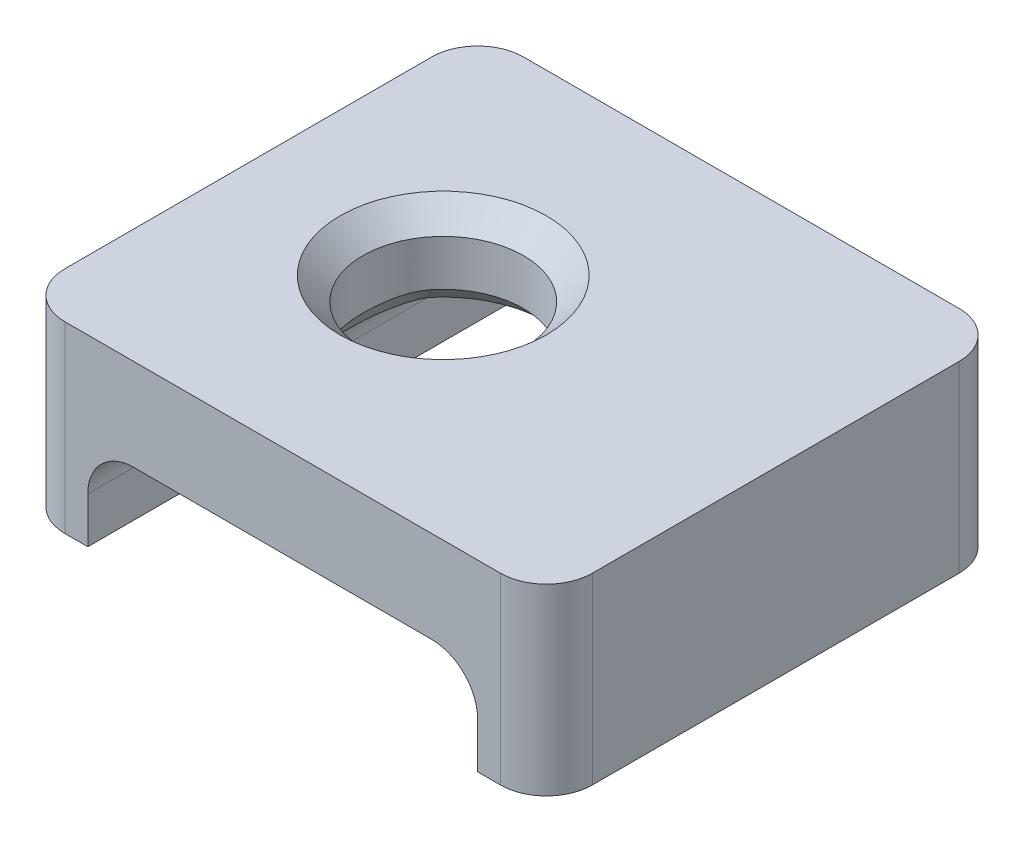
ISO-10303-21;
HEADER;
FILE_DESCRIPTION(('STEP AP214'),'2;1');
FILE_NAME('part.step','',(''),(''),'','','');
FILE_SCHEMA(('AUTOMOTIVE_DESIGN { 1 0 10303 214 1 1 1 1 }'));
ENDSEC;
DATA;
#1=APPLICATION_CONTEXT('core data for automotive mechanical design processes');
#2=APPLICATION_PROTOCOL_DEFINITION('international standard','automotive_design',2000,#1);
#3=PRODUCT_CONTEXT('',#1,'mechanical');
#4=PRODUCT('Part','Part','',(#3));
#5=PRODUCT_RELATED_PRODUCT_CATEGORY('part','',(#4));
#6=PRODUCT_DEFINITION_FORMATION('','',#4);
#7=PRODUCT_DEFINITION_CONTEXT('part definition',#1,'design');
#8=PRODUCT_DEFINITION('design','',#6,#7);
#9=PRODUCT_DEFINITION_SHAPE('','',#8);
#10=(LENGTH_UNIT() NAMED_UNIT(*) SI_UNIT(.MILLI.,.METRE.));
#11=(NAMED_UNIT(*) PLANE_ANGLE_UNIT() SI_UNIT($,.RADIAN.));
#12=(NAMED_UNIT(*) SI_UNIT($,.STERADIAN.) SOLID_ANGLE_UNIT());
#13=UNCERTAINTY_MEASURE_WITH_UNIT(LENGTH_MEASURE(1.E-05),#10,'distance_accuracy_value','');
#14=(GEOMETRIC_REPRESENTATION_CONTEXT(3) GLOBAL_UNCERTAINTY_ASSIGNED_CONTEXT((#13)) GLOBAL_UNIT_ASSIGNED_CONTEXT((#10,
#11,#12)) REPRESENTATION_CONTEXT('',''));
#15=CARTESIAN_POINT('',(0.,0.,0.));
#16=DIRECTION('',(0.,0.,1.));
#17=DIRECTION('',(1.,0.,0.));
#18=AXIS2_PLACEMENT_3D('',#15,#16,#17);
#19=CARTESIAN_POINT('',(1.5,0.,5.));
#20=DIRECTION('',(0.,1.,0.));
#21=DIRECTION('',(-1.,0.,0.));
#22=AXIS2_PLACEMENT_3D('',#19,#20,#21);
#23=PLANE('',#22);
#24=DIRECTION('',(0.,0.,-1.));
#25=VECTOR('',#24,1.);
#26=CARTESIAN_POINT('',(0.,0.,5.));
#27=LINE('',#26,#25);
#28=CARTESIAN_POINT('',(0.,0.,4.));
#29=VERTEX_POINT('',#28);
#30=CARTESIAN_POINT('',(0.,0.,-4.));
#31=VERTEX_POINT('',#30);
#32=EDGE_CURVE('E344',#29,#31,#27,.T.);
#33=ORIENTED_EDGE('',*,*,#32,.T.);
#34=CARTESIAN_POINT('',(1.,0.,-4.));
#35=DIRECTION('',(0.,1.,0.));
#36=DIRECTION('',(-1.,0.,0.));
#37=AXIS2_PLACEMENT_3D('',#34,#35,#36);
#38=CIRCLE('',#37,1.);
#39=CARTESIAN_POINT('',(1.,0.,-5.));
#40=VERTEX_POINT('',#39);
#41=EDGE_CURVE('E190',#31,#40,#38,.F.);
#42=ORIENTED_EDGE('',*,*,#41,.T.);
#43=DIRECTION('',(1.,0.,0.));
#44=VECTOR('',#43,1.);
#45=CARTESIAN_POINT('',(1.5,0.,-5.));
#46=LINE('',#45,#44);
#47=CARTESIAN_POINT('',(1.5,0.,-5.));
#48=VERTEX_POINT('',#47);
#49=EDGE_CURVE('E174',#40,#48,#46,.T.);
#50=ORIENTED_EDGE('',*,*,#49,.T.);
#51=DIRECTION('',(0.,0.,-1.));
#52=VECTOR('',#51,1.);
#53=CARTESIAN_POINT('',(1.5,0.,5.));
#54=LINE('',#53,#52);
#55=CARTESIAN_POINT('',(1.5,0.,5.));
#56=VERTEX_POINT('',#55);
#57=EDGE_CURVE('E167',#56,#48,#54,.T.);
#58=ORIENTED_EDGE('',*,*,#57,.F.);
#59=DIRECTION('',(1.,0.,0.));
#60=VECTOR('',#59,1.);
#61=CARTESIAN_POINT('',(1.5,0.,5.));
#62=LINE('',#61,#60);
#63=CARTESIAN_POINT('',(1.,0.,5.));
#64=VERTEX_POINT('',#63);
#65=EDGE_CURVE('E151',#64,#56,#62,.T.);
#66=ORIENTED_EDGE('',*,*,#65,.F.);
#67=CARTESIAN_POINT('',(1.,0.,4.));
#68=DIRECTION('',(0.,1.,0.));
#69=DIRECTION('',(-1.,0.,0.));
#70=AXIS2_PLACEMENT_3D('',#67,#68,#69);
#71=CIRCLE('',#70,1.);
#72=EDGE_CURVE('E188',#64,#29,#71,.F.);
#73=ORIENTED_EDGE('',*,*,#72,.T.);
#74=EDGE_LOOP('',(#33,#42,#50,#58,#66,#73));
#75=FACE_BOUND('',#74,.T.);
#76=ADVANCED_FACE('F32',(#75),#23,.F.);
#77=CARTESIAN_POINT('',(1.5,0.,5.));
#78=DIRECTION('',(-1.,0.,0.));
#79=DIRECTION('',(0.,0.,1.));
#80=AXIS2_PLACEMENT_3D('',#77,#78,#79);
#81=PLANE('',#80);
#82=DIRECTION('',(0.,1.,0.));
#83=VECTOR('',#82,1.);
#84=CARTESIAN_POINT('',(1.5,0.,-5.));
#85=LINE('',#84,#83);
#86=CARTESIAN_POINT('',(1.5,1.,-5.));
#87=VERTEX_POINT('',#86);
#88=EDGE_CURVE('E338',#48,#87,#85,.T.);
#89=ORIENTED_EDGE('',*,*,#88,.T.);
#90=DIRECTION('',(0.,0.,-1.));
#91=VECTOR('',#90,1.);
#92=CARTESIAN_POINT('',(1.5,1.,5.));
#93=LINE('',#92,#91);
#94=CARTESIAN_POINT('',(1.5,1.,5.));
#95=VERTEX_POINT('',#94);
#96=EDGE_CURVE('E169',#87,#95,#93,.F.);
#97=ORIENTED_EDGE('',*,*,#96,.T.);
#98=DIRECTION('',(0.,1.,0.));
#99=VECTOR('',#98,1.);
#100=CARTESIAN_POINT('',(1.5,0.,5.));
#101=LINE('',#100,#99);
#102=EDGE_CURVE('E155',#56,#95,#101,.T.);
#103=ORIENTED_EDGE('',*,*,#102,.F.);
#104=ORIENTED_EDGE('',*,*,#57,.T.);
#105=EDGE_LOOP('',(#89,#97,#103,#104));
#106=FACE_BOUND('',#105,.T.);
#107=ADVANCED_FACE('F166',(#106),#81,.F.);
#108=CARTESIAN_POINT('',(1.5,2.,5.));
#109=DIRECTION('',(0.,1.,0.));
#110=DIRECTION('',(-1.,0.,0.));
#111=AXIS2_PLACEMENT_3D('',#108,#109,#110);
#112=PLANE('',#111);
#113=DIRECTION('',(0.,0.,-1.));
#114=VECTOR('',#113,1.);
#115=CARTESIAN_POINT('',(2.5,2.,-5.));
#116=LINE('',#115,#114);
#117=CARTESIAN_POINT('',(2.5,2.,5.));
#118=VERTEX_POINT('',#117);
#119=CARTESIAN_POINT('',(2.5,2.,1.41421356237311));
#120=VERTEX_POINT('',#119);
#121=EDGE_CURVE('E228',#118,#120,#116,.T.);
#122=ORIENTED_EDGE('',*,*,#121,.T.);
#123=CARTESIAN_POINT('',(4.25,2.,0.));
#124=DIRECTION('',(0.,1.,0.));
#125=DIRECTION('',(-1.,0.,0.));
#126=AXIS2_PLACEMENT_3D('',#123,#124,#125);
#127=CIRCLE('',#126,2.25000000000001);
#128=CARTESIAN_POINT('',(2.5,2.,-1.41421356237311));
#129=VERTEX_POINT('',#128);
#130=EDGE_CURVE('E230',#120,#129,#127,.T.);
#131=ORIENTED_EDGE('',*,*,#130,.T.);
#132=DIRECTION('',(0.,0.,-1.));
#133=VECTOR('',#132,1.);
#134=CARTESIAN_POINT('',(2.5,2.,-5.));
#135=LINE('',#134,#133);
#136=CARTESIAN_POINT('',(2.5,2.,-5.));
#137=VERTEX_POINT('',#136);
#138=EDGE_CURVE('E220',#129,#137,#135,.T.);
#139=ORIENTED_EDGE('',*,*,#138,.T.);
#140=DIRECTION('',(1.,0.,0.));
#141=VECTOR('',#140,1.);
#142=CARTESIAN_POINT('',(1.5,2.,-5.));
#143=LINE('',#142,#141);
#144=CARTESIAN_POINT('',(9.,2.,-5.));
#145=VERTEX_POINT('',#144);
#146=EDGE_CURVE('E320',#137,#145,#143,.T.);
#147=ORIENTED_EDGE('',*,*,#146,.T.);
#148=DIRECTION('',(0.,0.,-1.));
#149=VECTOR('',#148,1.);
#150=CARTESIAN_POINT('',(9.,2.,5.));
#151=LINE('',#150,#149);
#152=CARTESIAN_POINT('',(9.,2.,5.));
#153=VERTEX_POINT('',#152);
#154=EDGE_CURVE('E317',#145,#153,#151,.F.);
#155=ORIENTED_EDGE('',*,*,#154,.T.);
#156=DIRECTION('',(1.,0.,0.));
#157=VECTOR('',#156,1.);
#158=CARTESIAN_POINT('',(1.5,2.,5.));
#159=LINE('',#158,#157);
#160=EDGE_CURVE('E170',#118,#153,#159,.T.);
#161=ORIENTED_EDGE('',*,*,#160,.F.);
#162=EDGE_LOOP('',(#122,#131,#139,#147,#155,#161));
#163=FACE_BOUND('',#162,.T.);
#164=ADVANCED_FACE('F304',(#163),#112,.F.);
#165=CARTESIAN_POINT('',(10.,2.,5.));
#166=DIRECTION('',(1.,0.,0.));
#167=DIRECTION('',(0.,0.,-1.));
#168=AXIS2_PLACEMENT_3D('',#165,#166,#167);
#169=PLANE('',#168);
#170=DIRECTION('',(0.,-1.,0.));
#171=VECTOR('',#170,1.);
#172=CARTESIAN_POINT('',(10.,2.,5.));
#173=LINE('',#172,#171);
#174=CARTESIAN_POINT('',(10.,1.,5.));
#175=VERTEX_POINT('',#174);
#176=CARTESIAN_POINT('',(10.,0.,5.));
#177=VERTEX_POINT('',#176);
#178=EDGE_CURVE('E324',#175,#177,#173,.T.);
#179=ORIENTED_EDGE('',*,*,#178,.F.);
#180=DIRECTION('',(0.,0.,-1.));
#181=VECTOR('',#180,1.);
#182=CARTESIAN_POINT('',(10.,1.,-5.));
#183=LINE('',#182,#181);
#184=CARTESIAN_POINT('',(10.,1.,-5.));
#185=VERTEX_POINT('',#184);
#186=EDGE_CURVE('E217',#175,#185,#183,.T.);
#187=ORIENTED_EDGE('',*,*,#186,.T.);
#188=DIRECTION('',(0.,-1.,0.));
#189=VECTOR('',#188,1.);
#190=CARTESIAN_POINT('',(10.,2.,-5.));
#191=LINE('',#190,#189);
#192=CARTESIAN_POINT('',(10.,0.,-5.));
#193=VERTEX_POINT('',#192);
#194=EDGE_CURVE('E331',#185,#193,#191,.T.);
#195=ORIENTED_EDGE('',*,*,#194,.T.);
#196=DIRECTION('',(0.,0.,-1.));
#197=VECTOR('',#196,1.);
#198=CARTESIAN_POINT('',(10.,0.,5.));
#199=LINE('',#198,#197);
#200=EDGE_CURVE('E177',#177,#193,#199,.T.);
#201=ORIENTED_EDGE('',*,*,#200,.F.);
#202=EDGE_LOOP('',(#179,#187,#195,#201));
#203=FACE_BOUND('',#202,.T.);
#204=ADVANCED_FACE('F329',(#203),#169,.F.);
#205=CARTESIAN_POINT('',(11.5,0.,5.));
#206=DIRECTION('',(0.,1.,0.));
#207=DIRECTION('',(-1.,0.,0.));
#208=AXIS2_PLACEMENT_3D('',#205,#206,#207);
#209=PLANE('',#208);
#210=DIRECTION('',(1.,0.,0.));
#211=VECTOR('',#210,1.);
#212=CARTESIAN_POINT('',(11.5,0.,-5.));
#213=LINE('',#212,#211);
#214=CARTESIAN_POINT('',(10.5,0.,-5.));
#215=VERTEX_POINT('',#214);
#216=EDGE_CURVE('E335',#193,#215,#213,.T.);
#217=ORIENTED_EDGE('',*,*,#216,.T.);
#218=CARTESIAN_POINT('',(10.5,0.,-4.));
#219=DIRECTION('',(0.,1.,0.));
#220=DIRECTION('',(-1.,0.,0.));
#221=AXIS2_PLACEMENT_3D('',#218,#219,#220);
#222=CIRCLE('',#221,1.);
#223=CARTESIAN_POINT('',(11.5,0.,-4.));
#224=VERTEX_POINT('',#223);
#225=EDGE_CURVE('E211',#215,#224,#222,.F.);
#226=ORIENTED_EDGE('',*,*,#225,.T.);
#227=DIRECTION('',(0.,0.,-1.));
#228=VECTOR('',#227,1.);
#229=CARTESIAN_POINT('',(11.5,0.,5.));
#230=LINE('',#229,#228);
#231=CARTESIAN_POINT('',(11.5,0.,4.));
#232=VERTEX_POINT('',#231);
#233=EDGE_CURVE('E182',#232,#224,#230,.T.);
#234=ORIENTED_EDGE('',*,*,#233,.F.);
#235=CARTESIAN_POINT('',(10.5,0.,4.));
#236=DIRECTION('',(0.,1.,0.));
#237=DIRECTION('',(-1.,0.,0.));
#238=AXIS2_PLACEMENT_3D('',#235,#236,#237);
#239=CIRCLE('',#238,1.);
#240=CARTESIAN_POINT('',(10.5,0.,5.));
#241=VERTEX_POINT('',#240);
#242=EDGE_CURVE('E209',#232,#241,#239,.F.);
#243=ORIENTED_EDGE('',*,*,#242,.T.);
#244=DIRECTION('',(1.,0.,0.));
#245=VECTOR('',#244,1.);
#246=CARTESIAN_POINT('',(11.5,0.,5.));
#247=LINE('',#246,#245);
#248=EDGE_CURVE('E384',#177,#241,#247,.T.);
#249=ORIENTED_EDGE('',*,*,#248,.F.);
#250=ORIENTED_EDGE('',*,*,#200,.T.);
#251=EDGE_LOOP('',(#217,#226,#234,#243,#249,#250));
#252=FACE_BOUND('',#251,.T.);
#253=ADVANCED_FACE('F417',(#252),#209,.F.);
#254=CARTESIAN_POINT('',(11.5,4.,5.));
#255=DIRECTION('',(-1.,0.,0.));
#256=DIRECTION('',(0.,-1.,0.));
#257=AXIS2_PLACEMENT_3D('',#254,#255,#256);
#258=PLANE('',#257);
#259=ORIENTED_EDGE('',*,*,#233,.T.);
#260=DIRECTION('',(0.,1.,0.));
#261=VECTOR('',#260,1.);
#262=CARTESIAN_POINT('',(11.5,4.,-4.));
#263=LINE('',#262,#261);
#264=CARTESIAN_POINT('',(11.5,4.,-4.));
#265=VERTEX_POINT('',#264);
#266=EDGE_CURVE('E206',#224,#265,#263,.T.);
#267=ORIENTED_EDGE('',*,*,#266,.T.);
#268=DIRECTION('',(0.,0.,-1.));
#269=VECTOR('',#268,1.);
#270=CARTESIAN_POINT('',(11.5,4.,5.));
#271=LINE('',#270,#269);
#272=CARTESIAN_POINT('',(11.5,4.,4.));
#273=VERTEX_POINT('',#272);
#274=EDGE_CURVE('E350',#273,#265,#271,.T.);
#275=ORIENTED_EDGE('',*,*,#274,.F.);
#276=DIRECTION('',(0.,1.,0.));
#277=VECTOR('',#276,1.);
#278=CARTESIAN_POINT('',(11.5,4.,4.));
#279=LINE('',#278,#277);
#280=EDGE_CURVE('E204',#273,#232,#279,.F.);
#281=ORIENTED_EDGE('',*,*,#280,.T.);
#282=EDGE_LOOP('',(#259,#267,#275,#281));
#283=FACE_BOUND('',#282,.T.);
#284=ADVANCED_FACE('F356',(#283),#258,.F.);
#285=CARTESIAN_POINT('',(0.,4.,5.));
#286=DIRECTION('',(0.,-1.,0.));
#287=DIRECTION('',(0.,0.,-1.));
#288=AXIS2_PLACEMENT_3D('',#285,#286,#287);
#289=PLANE('',#288);
#290=CARTESIAN_POINT('',(4.25,4.,0.));
#291=DIRECTION('',(0.,-1.,0.));
#292=DIRECTION('',(0.,0.,-1.));
#293=AXIS2_PLACEMENT_3D('',#290,#291,#292);
#294=CIRCLE('',#293,2.25);
#295=CARTESIAN_POINT('',(4.25,4.,-2.25));
#296=VERTEX_POINT('',#295);
#297=EDGE_CURVE('E11',#296,#296,#294,.T.);
#298=ORIENTED_EDGE('',*,*,#297,.T.);
#299=EDGE_LOOP('',(#298));
#300=FACE_BOUND('',#299,.T.);
#301=DIRECTION('',(-1.,0.,0.));
#302=VECTOR('',#301,1.);
#303=CARTESIAN_POINT('',(0.,4.,-5.));
#304=LINE('',#303,#302);
#305=CARTESIAN_POINT('',(10.5,4.,-5.));
#306=VERTEX_POINT('',#305);
#307=CARTESIAN_POINT('',(1.,4.,-5.));
#308=VERTEX_POINT('',#307);
#309=EDGE_CURVE('E161',#306,#308,#304,.T.);
#310=ORIENTED_EDGE('',*,*,#309,.T.);
#311=CARTESIAN_POINT('',(1.,4.,-4.));
#312=DIRECTION('',(0.,-1.,0.));
#313=DIRECTION('',(0.,0.,-1.));
#314=AXIS2_PLACEMENT_3D('',#311,#312,#313);
#315=CIRCLE('',#314,1.);
#316=CARTESIAN_POINT('',(0.,4.,-4.));
#317=VERTEX_POINT('',#316);
#318=EDGE_CURVE('E202',#308,#317,#315,.F.);
#319=ORIENTED_EDGE('',*,*,#318,.T.);
#320=DIRECTION('',(0.,0.,-1.));
#321=VECTOR('',#320,1.);
#322=CARTESIAN_POINT('',(0.,4.,5.));
#323=LINE('',#322,#321);
#324=CARTESIAN_POINT('',(0.,4.,4.));
#325=VERTEX_POINT('',#324);
#326=EDGE_CURVE('E346',#325,#317,#323,.T.);
#327=ORIENTED_EDGE('',*,*,#326,.F.);
#328=CARTESIAN_POINT('',(1.,4.,4.));
#329=DIRECTION('',(0.,-1.,0.));
#330=DIRECTION('',(0.,0.,-1.));
#331=AXIS2_PLACEMENT_3D('',#328,#329,#330);
#332=CIRCLE('',#331,1.);
#333=CARTESIAN_POINT('',(1.,4.,5.));
#334=VERTEX_POINT('',#333);
#335=EDGE_CURVE('E198',#325,#334,#332,.F.);
#336=ORIENTED_EDGE('',*,*,#335,.T.);
#337=DIRECTION('',(-1.,0.,0.));
#338=VECTOR('',#337,1.);
#339=CARTESIAN_POINT('',(0.,4.,5.));
#340=LINE('',#339,#338);
#341=CARTESIAN_POINT('',(10.5,4.,5.));
#342=VERTEX_POINT('',#341);
#343=EDGE_CURVE('E347',#342,#334,#340,.T.);
#344=ORIENTED_EDGE('',*,*,#343,.F.);
#345=CARTESIAN_POINT('',(10.5,4.,4.));
#346=DIRECTION('',(0.,-1.,0.));
#347=DIRECTION('',(0.,0.,-1.));
#348=AXIS2_PLACEMENT_3D('',#345,#346,#347);
#349=CIRCLE('',#348,1.);
#350=EDGE_CURVE('E196',#342,#273,#349,.F.);
#351=ORIENTED_EDGE('',*,*,#350,.T.);
#352=ORIENTED_EDGE('',*,*,#274,.T.);
#353=CARTESIAN_POINT('',(10.5,4.,-4.));
#354=DIRECTION('',(0.,-1.,0.));
#355=DIRECTION('',(0.,0.,-1.));
#356=AXIS2_PLACEMENT_3D('',#353,#354,#355);
#357=CIRCLE('',#356,1.);
#358=EDGE_CURVE('E200',#265,#306,#357,.F.);
#359=ORIENTED_EDGE('',*,*,#358,.T.);
#360=EDGE_LOOP('',(#310,#319,#327,#336,#344,#351,#352,#359));
#361=FACE_BOUND('',#360,.T.);
#362=ADVANCED_FACE('F367',(#300,#361),#289,.F.);
#363=CARTESIAN_POINT('',(0.,0.,5.));
#364=DIRECTION('',(1.,0.,0.));
#365=DIRECTION('',(0.,0.,-1.));
#366=AXIS2_PLACEMENT_3D('',#363,#364,#365);
#367=PLANE('',#366);
#368=ORIENTED_EDGE('',*,*,#326,.T.);
#369=DIRECTION('',(0.,-1.,0.));
#370=VECTOR('',#369,1.);
#371=CARTESIAN_POINT('',(0.,0.,-4.));
#372=LINE('',#371,#370);
#373=EDGE_CURVE('E179',#317,#31,#372,.T.);
#374=ORIENTED_EDGE('',*,*,#373,.T.);
#375=ORIENTED_EDGE('',*,*,#32,.F.);
#376=DIRECTION('',(0.,-1.,0.));
#377=VECTOR('',#376,1.);
#378=CARTESIAN_POINT('',(0.,0.,4.));
#379=LINE('',#378,#377);
#380=EDGE_CURVE('E176',#29,#325,#379,.F.);
#381=ORIENTED_EDGE('',*,*,#380,.T.);
#382=EDGE_LOOP('',(#368,#374,#375,#381));
#383=FACE_BOUND('',#382,.T.);
#384=ADVANCED_FACE('F376',(#383),#367,.F.);
#385=CARTESIAN_POINT('',(0.,0.,5.));
#386=DIRECTION('',(0.,0.,-1.));
#387=DIRECTION('',(-1.,0.,0.));
#388=AXIS2_PLACEMENT_3D('',#385,#386,#387);
#389=PLANE('',#388);
#390=ORIENTED_EDGE('',*,*,#343,.T.);
#391=DIRECTION('',(0.,-1.,0.));
#392=VECTOR('',#391,1.);
#393=CARTESIAN_POINT('',(1.,0.,5.));
#394=LINE('',#393,#392);
#395=EDGE_CURVE('E158',#334,#64,#394,.T.);
#396=ORIENTED_EDGE('',*,*,#395,.T.);
#397=ORIENTED_EDGE('',*,*,#65,.T.);
#398=ORIENTED_EDGE('',*,*,#102,.T.);
#399=CARTESIAN_POINT('',(2.5,1.,5.));
#400=DIRECTION('',(0.,0.,-1.));
#401=DIRECTION('',(-1.,0.,0.));
#402=AXIS2_PLACEMENT_3D('',#399,#400,#401);
#403=CIRCLE('',#402,1.);
#404=EDGE_CURVE('E234',#95,#118,#403,.T.);
#405=ORIENTED_EDGE('',*,*,#404,.T.);
#406=ORIENTED_EDGE('',*,*,#160,.T.);
#407=CARTESIAN_POINT('',(9.,1.,5.));
#408=DIRECTION('',(0.,0.,-1.));
#409=DIRECTION('',(-1.,0.,0.));
#410=AXIS2_PLACEMENT_3D('',#407,#408,#409);
#411=CIRCLE('',#410,1.);
#412=EDGE_CURVE('E311',#153,#175,#411,.T.);
#413=ORIENTED_EDGE('',*,*,#412,.T.);
#414=ORIENTED_EDGE('',*,*,#178,.T.);
#415=ORIENTED_EDGE('',*,*,#248,.T.);
#416=DIRECTION('',(0.,1.,0.));
#417=VECTOR('',#416,1.);
#418=CARTESIAN_POINT('',(10.5,0.,5.));
#419=LINE('',#418,#417);
#420=EDGE_CURVE('E213',#241,#342,#419,.T.);
#421=ORIENTED_EDGE('',*,*,#420,.T.);
#422=EDGE_LOOP('',(#390,#396,#397,#398,#405,#406,#413,#414,#415,#421));
#423=FACE_BOUND('',#422,.T.);
#424=ADVANCED_FACE('F154',(#423),#389,.F.);
#425=CARTESIAN_POINT('',(0.,0.,-5.));
#426=DIRECTION('',(0.,0.,-1.));
#427=DIRECTION('',(-1.,0.,0.));
#428=AXIS2_PLACEMENT_3D('',#425,#426,#427);
#429=PLANE('',#428);
#430=ORIENTED_EDGE('',*,*,#49,.F.);
#431=DIRECTION('',(0.,-1.,0.));
#432=VECTOR('',#431,1.);
#433=CARTESIAN_POINT('',(1.,4.,-5.));
#434=LINE('',#433,#432);
#435=EDGE_CURVE('E194',#40,#308,#434,.F.);
#436=ORIENTED_EDGE('',*,*,#435,.T.);
#437=ORIENTED_EDGE('',*,*,#309,.F.);
#438=DIRECTION('',(0.,1.,0.));
#439=VECTOR('',#438,1.);
#440=CARTESIAN_POINT('',(10.5,0.,-5.));
#441=LINE('',#440,#439);
#442=EDGE_CURVE('E192',#306,#215,#441,.F.);
#443=ORIENTED_EDGE('',*,*,#442,.T.);
#444=ORIENTED_EDGE('',*,*,#216,.F.);
#445=ORIENTED_EDGE('',*,*,#194,.F.);
#446=CARTESIAN_POINT('',(9.,1.,-5.));
#447=DIRECTION('',(0.,0.,-1.));
#448=DIRECTION('',(-1.,0.,0.));
#449=AXIS2_PLACEMENT_3D('',#446,#447,#448);
#450=CIRCLE('',#449,1.);
#451=EDGE_CURVE('E313',#185,#145,#450,.F.);
#452=ORIENTED_EDGE('',*,*,#451,.T.);
#453=ORIENTED_EDGE('',*,*,#146,.F.);
#454=CARTESIAN_POINT('',(2.5,1.,-5.));
#455=DIRECTION('',(0.,0.,-1.));
#456=DIRECTION('',(-1.,0.,0.));
#457=AXIS2_PLACEMENT_3D('',#454,#455,#456);
#458=CIRCLE('',#457,1.);
#459=EDGE_CURVE('E309',#137,#87,#458,.F.);
#460=ORIENTED_EDGE('',*,*,#459,.T.);
#461=ORIENTED_EDGE('',*,*,#88,.F.);
#462=EDGE_LOOP('',(#430,#436,#437,#443,#444,#445,#452,#453,#460,#461));
#463=FACE_BOUND('',#462,.T.);
#464=ADVANCED_FACE('F333',(#463),#429,.T.);
#465=CARTESIAN_POINT('',(4.25,0.,0.));
#466=DIRECTION('',(0.,1.,0.));
#467=DIRECTION('',(-1.,0.,0.));
#468=AXIS2_PLACEMENT_3D('',#465,#466,#467);
#469=CYLINDRICAL_SURFACE('',#468,1.75);
#470=CARTESIAN_POINT('',(4.25,2.5,0.));
#471=DIRECTION('',(0.,1.,0.));
#472=DIRECTION('',(0.,0.,1.));
#473=AXIS2_PLACEMENT_3D('',#470,#471,#472);
#474=CIRCLE('',#473,1.75);
#475=CARTESIAN_POINT('',(2.88888888888889,2.5,-1.09994388184575));
#476=VERTEX_POINT('',#475);
#477=CARTESIAN_POINT('',(2.88888888888889,2.5,1.09994388184575));
#478=VERTEX_POINT('',#477);
#479=EDGE_CURVE('E389',#476,#478,#474,.F.);
#480=ORIENTED_EDGE('',*,*,#479,.T.);
#481=CARTESIAN_POINT('',(2.88888888888889,2.5,-1.09994388184575));
#482=CARTESIAN_POINT('',(2.82582356888323,2.49997083705327,-1.02187884791348));
#483=CARTESIAN_POINT('',(2.77050281074774,2.4935551048069,-0.939833458936938));
#484=CARTESIAN_POINT('',(2.67439078406383,2.47575814562113,-0.767891592989331));
#485=CARTESIAN_POINT('',(2.63359274408477,2.46431907829342,-0.678005857656636));
#486=CARTESIAN_POINT('',(2.56697539867212,2.44243994170359,-0.489790965172285));
#487=CARTESIAN_POINT('',(2.54210446475017,2.43238297929967,-0.394108376672115));
#488=CARTESIAN_POINT('',(2.51699624207246,2.42179496644719,-0.248262333299768));
#489=CARTESIAN_POINT('',(2.51067095007772,2.419001525534,-0.19922640948802));
#490=CARTESIAN_POINT('',(2.50430068962096,2.41615926078744,-0.125102190355451));
#491=CARTESIAN_POINT('',(2.50269751125974,2.41543574703244,-0.10026932936966));
#492=CARTESIAN_POINT('',(2.50054912043425,2.41446373125526,-0.0504485568965353));
#493=CARTESIAN_POINT('',(2.50000454089939,2.41421562566349,-0.0253528565904893));
#494=CARTESIAN_POINT('',(2.49999552564426,2.41421152933136,0.0246703570711213));
#495=CARTESIAN_POINT('',(2.50052597169214,2.4144532010335,0.0495795927151091));
#496=CARTESIAN_POINT('',(2.50263911791798,2.41540938252611,0.0992344169700421));
#497=CARTESIAN_POINT('',(2.50422149449044,2.41612364923724,0.123973747621056));
#498=CARTESIAN_POINT('',(2.5105254222551,2.41893713641525,0.197931992235066));
#499=CARTESIAN_POINT('',(2.51680117686256,2.42171091611811,0.246891409358691));
#500=CARTESIAN_POINT('',(2.53346151396026,2.42874005306628,0.344135237816373));
#501=CARTESIAN_POINT('',(2.54385408037303,2.43299790044854,0.392442341248061));
#502=CARTESIAN_POINT('',(2.56254331818389,2.44014476832481,0.464334761906593));
#503=CARTESIAN_POINT('',(2.56930324419903,2.44265685411785,0.488238443981388));
#504=CARTESIAN_POINT('',(2.58387250379451,2.44786127137221,0.535855021568197));
#505=CARTESIAN_POINT('',(2.59169562846097,2.45055728944133,0.55959703923648));
#506=CARTESIAN_POINT('',(2.61655289790702,2.45872570813164,0.629933455381563));
#507=CARTESIAN_POINT('',(2.63501086702578,2.4642967208538,0.675828307469147));
#508=CARTESIAN_POINT('',(2.67564995473588,2.47497273475679,0.76573875866203));
#509=CARTESIAN_POINT('',(2.69782703495026,2.48007840134072,0.809749119063314));
#510=CARTESIAN_POINT('',(2.7459172022295,2.48902147288833,0.895918114669014));
#511=CARTESIAN_POINT('',(2.77184452213914,2.49286174804941,0.938093436304377));
#512=CARTESIAN_POINT('',(2.82749500548662,2.49835308624928,1.02052056956958));
#513=CARTESIAN_POINT('',(2.85737989458452,2.50000175207501,1.06096040552206));
#514=CARTESIAN_POINT('',(2.88888888888889,2.5,1.09994388184575));
#515=B_SPLINE_CURVE_WITH_KNOTS('',3,(#481,#482,#483,#484,#485,#486,#487,#488,#489,#490,#491,
#492,#493,#494,#495,#496,#497,#498,#499,#500,#501,#502,#503,#504,#505,#506,#507,#508,#509,#510,
#511,#512,#513,#514),.UNSPECIFIED.,.F.,.F.,(4,2,2,2,2,2,2,2,2,2,2,2,2,2,2,2,4),(0.,
0.000380813765573103,0.000761627531146205,0.00114244129671931,0.00133284817950586,
0.00142805162089914,0.00152325506229241,0.00161845850368569,0.00171366194507896,
0.00190406882786551,0.00209447571065207,0.00218967915204534,0.00228488259343862,
0.00247528947622517,0.00266569635901172,0.00285610324179827,0.00304651012458482),.UNSPECIFIED.);
#516=EDGE_CURVE('E42',#478,#476,#515,.F.);
#517=ORIENTED_EDGE('',*,*,#516,.T.);
#518=EDGE_LOOP('',(#480,#517));
#519=FACE_BOUND('',#518,.T.);
#520=CARTESIAN_POINT('',(4.25,3.50000000000001,0.));
#521=DIRECTION('',(0.,-1.,0.));
#522=DIRECTION('',(0.,0.,-1.));
#523=AXIS2_PLACEMENT_3D('',#520,#521,#522);
#524=CIRCLE('',#523,1.75);
#525=CARTESIAN_POINT('',(4.25,3.50000000000001,-1.75));
#526=VERTEX_POINT('',#525);
#527=EDGE_CURVE('E247',#526,#526,#524,.F.);
#528=ORIENTED_EDGE('',*,*,#527,.T.);
#529=EDGE_LOOP('',(#528));
#530=FACE_BOUND('',#529,.T.);
#531=ADVANCED_FACE('F397',(#519,#530),#469,.F.);
#532=CARTESIAN_POINT('',(1.,0.,-4.));
#533=DIRECTION('',(0.,1.,0.));
#534=DIRECTION('',(0.,0.,1.));
#535=AXIS2_PLACEMENT_3D('',#532,#533,#534);
#536=CYLINDRICAL_SURFACE('',#535,1.);
#537=ORIENTED_EDGE('',*,*,#318,.F.);
#538=ORIENTED_EDGE('',*,*,#435,.F.);
#539=ORIENTED_EDGE('',*,*,#41,.F.);
#540=ORIENTED_EDGE('',*,*,#373,.F.);
#541=EDGE_LOOP('',(#537,#538,#539,#540));
#542=FACE_BOUND('',#541,.T.);
#543=ADVANCED_FACE('F371',(#542),#536,.T.);
#544=CARTESIAN_POINT('',(10.5,4.,-4.));
#545=DIRECTION('',(0.,-1.,0.));
#546=DIRECTION('',(1.,0.,0.));
#547=AXIS2_PLACEMENT_3D('',#544,#545,#546);
#548=CYLINDRICAL_SURFACE('',#547,1.);
#549=ORIENTED_EDGE('',*,*,#225,.F.);
#550=ORIENTED_EDGE('',*,*,#442,.F.);
#551=ORIENTED_EDGE('',*,*,#358,.F.);
#552=ORIENTED_EDGE('',*,*,#266,.F.);
#553=EDGE_LOOP('',(#549,#550,#551,#552));
#554=FACE_BOUND('',#553,.T.);
#555=ADVANCED_FACE('F363',(#554),#548,.T.);
#556=CARTESIAN_POINT('',(1.,0.,4.));
#557=DIRECTION('',(0.,-1.,0.));
#558=DIRECTION('',(0.,0.,-1.));
#559=AXIS2_PLACEMENT_3D('',#556,#557,#558);
#560=CYLINDRICAL_SURFACE('',#559,1.);
#561=ORIENTED_EDGE('',*,*,#335,.F.);
#562=ORIENTED_EDGE('',*,*,#380,.F.);
#563=ORIENTED_EDGE('',*,*,#72,.F.);
#564=ORIENTED_EDGE('',*,*,#395,.F.);
#565=EDGE_LOOP('',(#561,#562,#563,#564));
#566=FACE_BOUND('',#565,.T.);
#567=ADVANCED_FACE('F380',(#566),#560,.T.);
#568=CARTESIAN_POINT('',(10.5,0.,4.));
#569=DIRECTION('',(0.,1.,0.));
#570=DIRECTION('',(-1.,0.,0.));
#571=AXIS2_PLACEMENT_3D('',#568,#569,#570);
#572=CYLINDRICAL_SURFACE('',#571,1.);
#573=ORIENTED_EDGE('',*,*,#242,.F.);
#574=ORIENTED_EDGE('',*,*,#280,.F.);
#575=ORIENTED_EDGE('',*,*,#350,.F.);
#576=ORIENTED_EDGE('',*,*,#420,.F.);
#577=EDGE_LOOP('',(#573,#574,#575,#576));
#578=FACE_BOUND('',#577,.T.);
#579=ADVANCED_FACE('F433',(#578),#572,.T.);
#580=CARTESIAN_POINT('',(9.,1.,5.));
#581=DIRECTION('',(0.,0.,1.));
#582=DIRECTION('',(1.,0.,0.));
#583=AXIS2_PLACEMENT_3D('',#580,#581,#582);
#584=CYLINDRICAL_SURFACE('',#583,1.);
#585=ORIENTED_EDGE('',*,*,#412,.F.);
#586=ORIENTED_EDGE('',*,*,#154,.F.);
#587=ORIENTED_EDGE('',*,*,#451,.F.);
#588=ORIENTED_EDGE('',*,*,#186,.F.);
#589=EDGE_LOOP('',(#585,#586,#587,#588));
#590=FACE_BOUND('',#589,.T.);
#591=ADVANCED_FACE('F259',(#590),#584,.F.);
#592=CARTESIAN_POINT('',(2.5,1.,5.));
#593=DIRECTION('',(0.,0.,1.));
#594=DIRECTION('',(1.,0.,0.));
#595=AXIS2_PLACEMENT_3D('',#592,#593,#594);
#596=CYLINDRICAL_SURFACE('',#595,1.);
#597=ORIENTED_EDGE('',*,*,#138,.F.);
#598=CARTESIAN_POINT('',(2.5,2.,1.41421356237311));
#599=CARTESIAN_POINT('',(2.47299229059625,2.00000116805001,1.36409194995694));
#600=CARTESIAN_POINT('',(2.44737667136389,1.99890205749909,1.31209787514849));
#601=CARTESIAN_POINT('',(2.39967625707722,1.9952411653667,1.20612013240376));
#602=CARTESIAN_POINT('',(2.37745284000084,1.99268098192477,1.15189471884568));
#603=CARTESIAN_POINT('',(2.33623269662942,1.98671893422792,1.04110601023875));
#604=CARTESIAN_POINT('',(2.31722377072331,1.98331515650398,0.984521261128));
#605=CARTESIAN_POINT('',(2.28239026697716,1.97619781390308,0.868922109612091));
#606=CARTESIAN_POINT('',(2.26656915058339,1.97248380542016,0.809914442618238));
#607=CARTESIAN_POINT('',(2.245262919635,1.96703819296135,0.719481907597364));
#608=CARTESIAN_POINT('',(2.23855738420439,1.96524084758136,0.688956456299917));
#609=CARTESIAN_POINT('',(2.22606944740911,1.96177123607867,0.627735142263841));
#610=CARTESIAN_POINT('',(2.2202752251047,1.96009651221496,0.597001836706467));
#611=CARTESIAN_POINT('',(2.20425587842557,1.95533193363551,0.504568724522961));
#612=CARTESIAN_POINT('',(2.1953479643446,1.9524933687101,0.442459591458217));
#613=CARTESIAN_POINT('',(2.18106767540828,1.94780727741282,0.317431812052583));
#614=CARTESIAN_POINT('',(2.17568845717018,1.9459580909432,0.254483990001486));
#615=CARTESIAN_POINT('',(2.17028509051604,1.94408243282497,0.159394818377444));
#616=CARTESIAN_POINT('',(2.16892876773921,1.9436062550174,0.127587107532719));
#617=CARTESIAN_POINT('',(2.16711749954564,1.942968800689,0.063745190633905));
#618=CARTESIAN_POINT('',(2.16666283150462,1.94280768622084,0.0317190305173545));
#619=CARTESIAN_POINT('',(2.16667055886612,1.94281041710906,-0.0325965298993987));
#620=CARTESIAN_POINT('',(2.16713734132473,1.94297582083686,-0.0648624303002337));
#621=CARTESIAN_POINT('',(2.16897881917486,1.94362383135493,-0.128917709184873));
#622=CARTESIAN_POINT('',(2.17035297205695,1.94410617385859,-0.160845673329705));
#623=CARTESIAN_POINT('',(2.17581319530292,1.94600101702206,-0.256148240739203));
#624=CARTESIAN_POINT('',(2.18123487425582,1.94786331099708,-0.319194429386228));
#625=CARTESIAN_POINT('',(2.20275620768414,1.9549219861352,-0.506710768291098));
#626=CARTESIAN_POINT('',(2.22407415160452,1.9616266278948,-0.629731242468895));
#627=CARTESIAN_POINT('',(2.28117473266328,1.97621271876987,-0.871721815454009));
#628=CARTESIAN_POINT('',(2.31614448222666,1.98383876384076,-0.987289192725559));
#629=CARTESIAN_POINT('',(2.398526218088,1.99570340311125,-1.20835730260822));
#630=CARTESIAN_POINT('',(2.44594401142372,1.99998055803551,-1.31384423303162));
#631=CARTESIAN_POINT('',(2.5,2.,-1.41421356237311));
#632=B_SPLINE_CURVE_WITH_KNOTS('',3,(#598,#599,#600,#601,#602,#603,#604,#605,#606,#607,#608,
#609,#610,#611,#612,#613,#614,#615,#616,#617,#618,#619,#620,#621,#622,#623,#624,#625,#626,#627,
#628,#629,#630,#631),.UNSPECIFIED.,.F.,.F.,(4,2,2,2,2,2,2,2,2,2,2,2,2,2,2,2,4),(0.,
0.000190406882786551,0.000380813765573103,0.000571220648359654,0.000761627531146206,
0.000856830972539481,0.000952034413932757,0.00114244129671931,0.00133284817950586,
0.00142805162089914,0.00152325506229241,0.00161845850368569,0.00171366194507896,
0.00190406882786551,0.00228488259343862,0.00266569635901172,0.00304651012458482),.UNSPECIFIED.);
#633=EDGE_CURVE('E233',#129,#120,#632,.F.);
#634=ORIENTED_EDGE('',*,*,#633,.T.);
#635=ORIENTED_EDGE('',*,*,#121,.F.);
#636=ORIENTED_EDGE('',*,*,#404,.F.);
#637=ORIENTED_EDGE('',*,*,#96,.F.);
#638=ORIENTED_EDGE('',*,*,#459,.F.);
#639=EDGE_LOOP('',(#597,#634,#635,#636,#637,#638));
#640=FACE_BOUND('',#639,.T.);
#641=ADVANCED_FACE('F248',(#640),#596,.F.);
#642=CARTESIAN_POINT('',(2.5,2.,-1.41421356237311));
#643=CARTESIAN_POINT('',(2.44594401142372,1.99998055803551,-1.31384423303162));
#644=CARTESIAN_POINT('',(2.398526218088,1.99570340311125,-1.20835730260822));
#645=CARTESIAN_POINT('',(2.31614448222666,1.98383876384076,-0.987289192725559));
#646=CARTESIAN_POINT('',(2.28117473266328,1.97621271876987,-0.871721815454009));
#647=CARTESIAN_POINT('',(2.22407415160452,1.9616266278948,-0.629731242468895));
#648=CARTESIAN_POINT('',(2.20275620768414,1.9549219861352,-0.506710768291098));
#649=CARTESIAN_POINT('',(2.18123487425582,1.94786331099708,-0.319194429386228));
#650=CARTESIAN_POINT('',(2.17581319530292,1.94600101702206,-0.256148240739203));
#651=CARTESIAN_POINT('',(2.17035297205695,1.94410617385859,-0.160845673329705));
#652=CARTESIAN_POINT('',(2.16897881917486,1.94362383135493,-0.128917709184873));
#653=CARTESIAN_POINT('',(2.16713734132473,1.94297582083686,-0.0648624303002337));
#654=CARTESIAN_POINT('',(2.16667055886612,1.94281041710906,-0.0325965298993987));
#655=CARTESIAN_POINT('',(2.16666283150462,1.94280768622084,0.0317190305173545));
#656=CARTESIAN_POINT('',(2.16711749954564,1.942968800689,0.063745190633905));
#657=CARTESIAN_POINT('',(2.16892876773921,1.9436062550174,0.127587107532719));
#658=CARTESIAN_POINT('',(2.17028509051604,1.94408243282497,0.159394818377444));
#659=CARTESIAN_POINT('',(2.17568845717018,1.9459580909432,0.254483990001486));
#660=CARTESIAN_POINT('',(2.18106767540828,1.94780727741282,0.317431812052583));
#661=CARTESIAN_POINT('',(2.1953479643446,1.9524933687101,0.442459591458217));
#662=CARTESIAN_POINT('',(2.20425587842557,1.95533193363551,0.504568724522961));
#663=CARTESIAN_POINT('',(2.2202752251047,1.96009651221496,0.597001836706467));
#664=CARTESIAN_POINT('',(2.22606944740911,1.96177123607867,0.627735142263841));
#665=CARTESIAN_POINT('',(2.23855738420439,1.96524084758136,0.688956456299917));
#666=CARTESIAN_POINT('',(2.245262919635,1.96703819296135,0.719481907597364));
#667=CARTESIAN_POINT('',(2.26656915058339,1.97248380542016,0.809914442618238));
#668=CARTESIAN_POINT('',(2.28239026697716,1.97619781390308,0.868922109612091));
#669=CARTESIAN_POINT('',(2.31722377072331,1.98331515650398,0.984521261128));
#670=CARTESIAN_POINT('',(2.33623269662942,1.98671893422792,1.04110601023875));
#671=CARTESIAN_POINT('',(2.37745284000084,1.99268098192477,1.15189471884568));
#672=CARTESIAN_POINT('',(2.39967625707722,1.9952411653667,1.20612013240376));
#673=CARTESIAN_POINT('',(2.44737667136389,1.99890205749909,1.31209787514849));
#674=CARTESIAN_POINT('',(2.47299229059625,2.00000116805001,1.36409194995694));
#675=CARTESIAN_POINT('',(2.5,2.,1.41421356237311));
#676=CARTESIAN_POINT('',(2.88888888888889,2.5,-1.09994388184575));
#677=CARTESIAN_POINT('',(2.82582356888323,2.49997083705327,-1.02187884791348));
#678=CARTESIAN_POINT('',(2.77050281074774,2.4935551048069,-0.939833458936938));
#679=CARTESIAN_POINT('',(2.67439078406383,2.47575814562113,-0.767891592989331));
#680=CARTESIAN_POINT('',(2.63359274408477,2.46431907829342,-0.678005857656636));
#681=CARTESIAN_POINT('',(2.56697539867212,2.44243994170359,-0.489790965172285));
#682=CARTESIAN_POINT('',(2.54210446475017,2.43238297929967,-0.394108376672115));
#683=CARTESIAN_POINT('',(2.51699624207246,2.42179496644719,-0.248262333299768));
#684=CARTESIAN_POINT('',(2.51067095007772,2.419001525534,-0.19922640948802));
#685=CARTESIAN_POINT('',(2.50430068962096,2.41615926078744,-0.125102190355451));
#686=CARTESIAN_POINT('',(2.50269751125974,2.41543574703244,-0.10026932936966));
#687=CARTESIAN_POINT('',(2.50054912043425,2.41446373125526,-0.0504485568965353));
#688=CARTESIAN_POINT('',(2.50000454089939,2.41421562566349,-0.0253528565904893));
#689=CARTESIAN_POINT('',(2.49999552564426,2.41421152933136,0.0246703570711213));
#690=CARTESIAN_POINT('',(2.50052597169214,2.4144532010335,0.0495795927151091));
#691=CARTESIAN_POINT('',(2.50263911791798,2.41540938252611,0.0992344169700421));
#692=CARTESIAN_POINT('',(2.50422149449044,2.41612364923724,0.123973747621056));
#693=CARTESIAN_POINT('',(2.5105254222551,2.41893713641525,0.197931992235066));
#694=CARTESIAN_POINT('',(2.51680117686256,2.42171091611811,0.246891409358691));
#695=CARTESIAN_POINT('',(2.53346151396026,2.42874005306628,0.344135237816373));
#696=CARTESIAN_POINT('',(2.54385408037303,2.43299790044854,0.392442341248061));
#697=CARTESIAN_POINT('',(2.56254331818389,2.44014476832481,0.464334761906593));
#698=CARTESIAN_POINT('',(2.56930324419903,2.44265685411785,0.488238443981388));
#699=CARTESIAN_POINT('',(2.58387250379451,2.44786127137221,0.535855021568197));
#700=CARTESIAN_POINT('',(2.59169562846097,2.45055728944133,0.55959703923648));
#701=CARTESIAN_POINT('',(2.61655289790702,2.45872570813164,0.629933455381563));
#702=CARTESIAN_POINT('',(2.63501086702578,2.4642967208538,0.675828307469147));
#703=CARTESIAN_POINT('',(2.67564995473588,2.47497273475679,0.76573875866203));
#704=CARTESIAN_POINT('',(2.69782703495026,2.48007840134072,0.809749119063314));
#705=CARTESIAN_POINT('',(2.7459172022295,2.48902147288833,0.895918114669014));
#706=CARTESIAN_POINT('',(2.77184452213914,2.49286174804941,0.938093436304377));
#707=CARTESIAN_POINT('',(2.82749500548662,2.49835308624928,1.02052056956958));
#708=CARTESIAN_POINT('',(2.85737989458452,2.50000175207501,1.06096040552206));
#709=CARTESIAN_POINT('',(2.88888888888889,2.5,1.09994388184575));
#710=B_SPLINE_SURFACE_WITH_KNOTS('',1,3,((#642,#643,#644,#645,#646,#647,#648,#649,#650,#651,
#652,#653,#654,#655,#656,#657,#658,#659,#660,#661,#662,#663,#664,#665,#666,#667,#668,#669,#670,
#671,#672,#673,#674,#675),(#676,#677,#678,#679,#680,#681,#682,#683,#684,#685,#686,#687,#688,
#689,#690,#691,#692,#693,#694,#695,#696,#697,#698,#699,#700,#701,#702,#703,#704,#705,#706,#707,
#708,#709)),.UNSPECIFIED.,.F.,.F.,.F.,(2,2),(4,2,2,2,2,2,2,2,2,2,2,2,2,2,2,2,4),(0.,1.),(0.,
0.000380813765573103,0.000761627531146205,0.00114244129671931,0.00133284817950586,
0.00142805162089914,0.00152325506229241,0.00161845850368569,0.00171366194507896,
0.00190406882786551,0.00209447571065207,0.00218967915204534,0.00228488259343862,
0.00247528947622517,0.00266569635901172,0.00285610324179827,0.00304651012458482),.UNSPECIFIED.);
#711=CARTESIAN_POINT('',(2.5,2.,-1.41421356237311));
#712=CARTESIAN_POINT('',(2.5162037037037,2.02083333333333,-1.40111899235114));
#713=CARTESIAN_POINT('',(2.53240740740741,2.04166666666667,-1.38802442232916));
#714=CARTESIAN_POINT('',(2.56481481481482,2.08333333333333,-1.36183528228521));
#715=CARTESIAN_POINT('',(2.58101851851852,2.10416666666667,-1.34874071226324));
#716=CARTESIAN_POINT('',(2.61342592592593,2.14583333333333,-1.32255157221929));
#717=CARTESIAN_POINT('',(2.62962962962963,2.16666666666667,-1.30945700219732));
#718=CARTESIAN_POINT('',(2.66203703703704,2.20833333333333,-1.28326786215337));
#719=CARTESIAN_POINT('',(2.67824074074074,2.22916666666667,-1.2701732921314));
#720=CARTESIAN_POINT('',(2.71064814814815,2.27083333333334,-1.24398415208745));
#721=CARTESIAN_POINT('',(2.72685185185185,2.29166666666667,-1.23088958206548));
#722=CARTESIAN_POINT('',(2.75925925925926,2.33333333333334,-1.20470044202153));
#723=CARTESIAN_POINT('',(2.77546296296297,2.35416666666667,-1.19160587199956));
#724=CARTESIAN_POINT('',(2.80787037037037,2.39583333333334,-1.16541673195561));
#725=CARTESIAN_POINT('',(2.82407407407408,2.41666666666667,-1.15232216193364));
#726=CARTESIAN_POINT('',(2.85648148148149,2.45833333333334,-1.12613302188969));
#727=CARTESIAN_POINT('',(2.87268518518519,2.47916666666667,-1.11303845186772));
#728=CARTESIAN_POINT('',(2.88888888888889,2.5,-1.09994388184575));
#729=B_SPLINE_CURVE_WITH_KNOTS('',3,(#711,#712,#713,#714,#715,#716,#717,#718,#719,#720,#721,
#722,#723,#724,#725,#726,#727,#728),.UNSPECIFIED.,.F.,.F.,(4,2,2,2,2,2,2,2,4),(0.,
0.0883883476483194,0.176776695296639,0.265165042944958,0.353553390593278,0.441941738241597,
0.530330085889916,0.618718433538236,0.707106781186555),.UNSPECIFIED.);
#730=EDGE_CURVE('E302',#476,#129,#729,.F.);
#731=CARTESIAN_POINT('',(2.88888888888889,2.5,1.09994388184575));
#732=CARTESIAN_POINT('',(2.5,2.,1.41421356237311));
#733=B_SPLINE_CURVE_WITH_KNOTS('',1,(#731,#732),.UNSPECIFIED.,.F.,.F.,(2,2),(0.,1.),.UNSPECIFIED.);
#734=EDGE_CURVE('E50',#120,#478,#733,.F.);
#735=ORIENTED_EDGE('',*,*,#730,.F.);
#736=ORIENTED_EDGE('',*,*,#516,.F.);
#737=ORIENTED_EDGE('',*,*,#734,.F.);
#738=ORIENTED_EDGE('',*,*,#633,.F.);
#739=EDGE_LOOP('',(#735,#736,#737,#738));
#740=FACE_BOUND('',#739,.T.);
#741=ADVANCED_FACE('F258',(#740),#710,.T.);
#742=CARTESIAN_POINT('',(4.25,2.,0.));
#743=DIRECTION('',(0.,-1.,0.));
#744=DIRECTION('',(0.,0.,-1.));
#745=AXIS2_PLACEMENT_3D('',#742,#743,#744);
#746=CONICAL_SURFACE('',#745,2.25000000000001,0.785398163397453);
#747=ORIENTED_EDGE('',*,*,#734,.T.);
#748=ORIENTED_EDGE('',*,*,#479,.F.);
#749=ORIENTED_EDGE('',*,*,#730,.T.);
#750=ORIENTED_EDGE('',*,*,#130,.F.);
#751=EDGE_LOOP('',(#747,#748,#749,#750));
#752=FACE_BOUND('',#751,.T.);
#753=ADVANCED_FACE('F261',(#752),#746,.F.);
#754=CARTESIAN_POINT('',(4.25,3.50000000000001,0.));
#755=DIRECTION('',(0.,1.,0.));
#756=DIRECTION('',(0.,0.,1.));
#757=AXIS2_PLACEMENT_3D('',#754,#755,#756);
#758=CONICAL_SURFACE('',#757,1.75,0.785398163397451);
#759=ORIENTED_EDGE('',*,*,#297,.F.);
#760=EDGE_LOOP('',(#759));
#761=FACE_BOUND('',#760,.T.);
#762=ORIENTED_EDGE('',*,*,#527,.F.);
#763=EDGE_LOOP('',(#762));
#764=FACE_BOUND('',#763,.T.);
#765=ADVANCED_FACE('F34',(#761,#764),#758,.F.);
#766=CLOSED_SHELL('',(#76,#107,#164,#204,#253,#284,#362,#384,#424,#464,#531,#543,#555,#567,#579,
#591,#641,#741,#753,#765));
#767=MANIFOLD_SOLID_BREP('B2',#766);
#768=ADVANCED_BREP_SHAPE_REPRESENTATION('',(#18,#767),#14);
#769=SHAPE_DEFINITION_REPRESENTATION(#9,#768);
ENDSEC;
END-ISO-10303-21;
